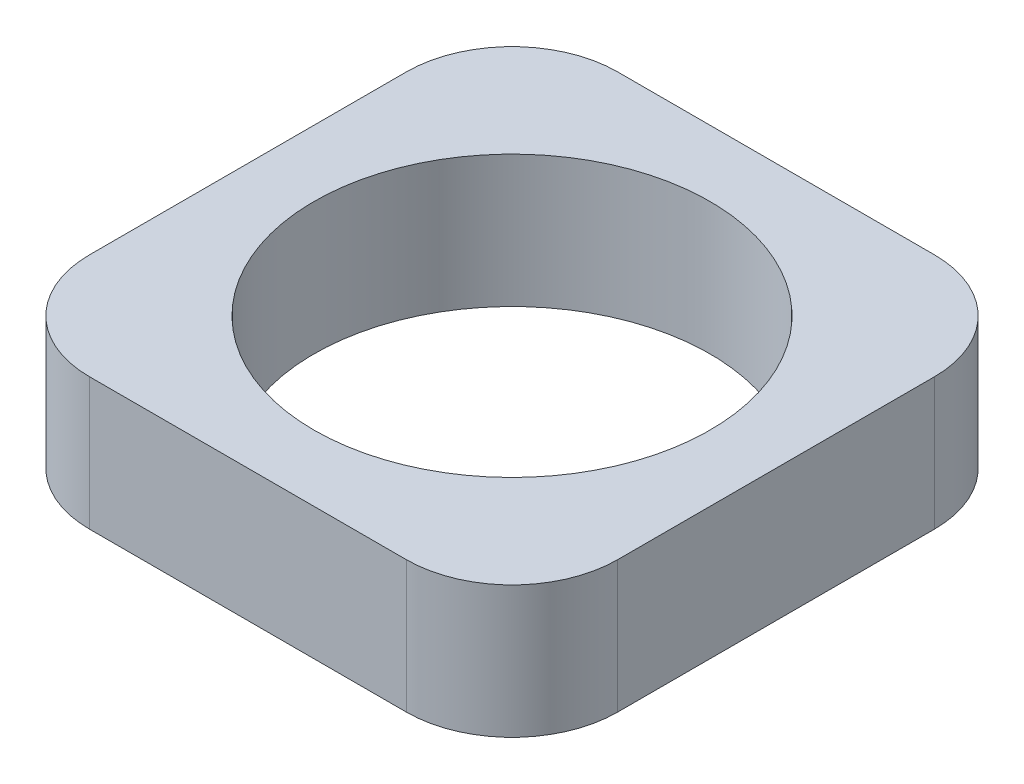
ISO-10303-21;
HEADER;
FILE_DESCRIPTION(('STEP AP214'),'2;1');
FILE_NAME('part.step','',(''),(''),'','','');
FILE_SCHEMA(('AUTOMOTIVE_DESIGN { 1 0 10303 214 1 1 1 1 }'));
ENDSEC;
DATA;
#1=APPLICATION_CONTEXT('core data for automotive mechanical design processes');
#2=APPLICATION_PROTOCOL_DEFINITION('international standard','automotive_design',2000,#1);
#3=PRODUCT_CONTEXT('',#1,'mechanical');
#4=PRODUCT('Part','Part','',(#3));
#5=PRODUCT_RELATED_PRODUCT_CATEGORY('part','',(#4));
#6=PRODUCT_DEFINITION_FORMATION('','',#4);
#7=PRODUCT_DEFINITION_CONTEXT('part definition',#1,'design');
#8=PRODUCT_DEFINITION('design','',#6,#7);
#9=PRODUCT_DEFINITION_SHAPE('','',#8);
#10=(LENGTH_UNIT() NAMED_UNIT(*) SI_UNIT(.MILLI.,.METRE.));
#11=(NAMED_UNIT(*) PLANE_ANGLE_UNIT() SI_UNIT($,.RADIAN.));
#12=(NAMED_UNIT(*) SI_UNIT($,.STERADIAN.) SOLID_ANGLE_UNIT());
#13=UNCERTAINTY_MEASURE_WITH_UNIT(LENGTH_MEASURE(1.E-05),#10,'distance_accuracy_value','');
#14=(GEOMETRIC_REPRESENTATION_CONTEXT(3) GLOBAL_UNCERTAINTY_ASSIGNED_CONTEXT((#13)) GLOBAL_UNIT_ASSIGNED_CONTEXT((#10,
#11,#12)) REPRESENTATION_CONTEXT('',''));
#15=CARTESIAN_POINT('',(0.,0.,0.));
#16=DIRECTION('',(0.,0.,1.));
#17=DIRECTION('',(1.,0.,0.));
#18=AXIS2_PLACEMENT_3D('',#15,#16,#17);
#19=CARTESIAN_POINT('',(-6.,5.,6.));
#20=DIRECTION('',(0.,-1.,0.));
#21=DIRECTION('',(0.,0.,-1.));
#22=AXIS2_PLACEMENT_3D('',#19,#20,#21);
#23=CYLINDRICAL_SURFACE('',#22,4.);
#24=CARTESIAN_POINT('',(-6.,0.,6.));
#25=DIRECTION('',(0.,1.,0.));
#26=DIRECTION('',(0.,0.,1.));
#27=AXIS2_PLACEMENT_3D('',#24,#25,#26);
#28=CIRCLE('',#27,4.);
#29=CARTESIAN_POINT('',(-10.,0.,5.99999999999997));
#30=VERTEX_POINT('',#29);
#31=CARTESIAN_POINT('',(-5.99999999999997,0.,10.));
#32=VERTEX_POINT('',#31);
#33=EDGE_CURVE('E130',#30,#32,#28,.T.);
#34=ORIENTED_EDGE('',*,*,#33,.T.);
#35=DIRECTION('',(0.,-1.,0.));
#36=VECTOR('',#35,1.);
#37=CARTESIAN_POINT('',(-5.99999999999997,5.,10.));
#38=LINE('',#37,#36);
#39=CARTESIAN_POINT('',(-5.99999999999997,5.,10.));
#40=VERTEX_POINT('',#39);
#41=EDGE_CURVE('E11',#40,#32,#38,.T.);
#42=ORIENTED_EDGE('',*,*,#41,.F.);
#43=CARTESIAN_POINT('',(-6.,5.,6.));
#44=DIRECTION('',(0.,1.,0.));
#45=DIRECTION('',(0.,0.,1.));
#46=AXIS2_PLACEMENT_3D('',#43,#44,#45);
#47=CIRCLE('',#46,4.);
#48=CARTESIAN_POINT('',(-10.,5.,5.99999999999997));
#49=VERTEX_POINT('',#48);
#50=EDGE_CURVE('E145',#49,#40,#47,.T.);
#51=ORIENTED_EDGE('',*,*,#50,.F.);
#52=DIRECTION('',(0.,-1.,0.));
#53=VECTOR('',#52,1.);
#54=CARTESIAN_POINT('',(-10.,5.,5.99999999999997));
#55=LINE('',#54,#53);
#56=EDGE_CURVE('E126',#49,#30,#55,.T.);
#57=ORIENTED_EDGE('',*,*,#56,.T.);
#58=EDGE_LOOP('',(#34,#42,#51,#57));
#59=FACE_BOUND('',#58,.T.);
#60=ADVANCED_FACE('F34',(#59),#23,.T.);
#61=CARTESIAN_POINT('',(-5.99999999999997,5.,10.));
#62=DIRECTION('',(0.,0.,-1.));
#63=DIRECTION('',(-1.,0.,0.));
#64=AXIS2_PLACEMENT_3D('',#61,#62,#63);
#65=PLANE('',#64);
#66=DIRECTION('',(1.,0.,0.));
#67=VECTOR('',#66,1.);
#68=CARTESIAN_POINT('',(-5.99999999999997,0.,10.));
#69=LINE('',#68,#67);
#70=CARTESIAN_POINT('',(5.99999999999998,0.,10.));
#71=VERTEX_POINT('',#70);
#72=EDGE_CURVE('E133',#32,#71,#69,.T.);
#73=ORIENTED_EDGE('',*,*,#72,.T.);
#74=DIRECTION('',(0.,-1.,0.));
#75=VECTOR('',#74,1.);
#76=CARTESIAN_POINT('',(5.99999999999998,5.,10.));
#77=LINE('',#76,#75);
#78=CARTESIAN_POINT('',(5.99999999999998,5.,10.));
#79=VERTEX_POINT('',#78);
#80=EDGE_CURVE('E42',#79,#71,#77,.T.);
#81=ORIENTED_EDGE('',*,*,#80,.F.);
#82=DIRECTION('',(1.,0.,0.));
#83=VECTOR('',#82,1.);
#84=CARTESIAN_POINT('',(-5.99999999999997,5.,10.));
#85=LINE('',#84,#83);
#86=EDGE_CURVE('E93',#40,#79,#85,.T.);
#87=ORIENTED_EDGE('',*,*,#86,.F.);
#88=ORIENTED_EDGE('',*,*,#41,.T.);
#89=EDGE_LOOP('',(#73,#81,#87,#88));
#90=FACE_BOUND('',#89,.T.);
#91=ADVANCED_FACE('F201',(#90),#65,.F.);
#92=CARTESIAN_POINT('',(6.,5.,6.));
#93=DIRECTION('',(0.,-1.,0.));
#94=DIRECTION('',(0.,0.,-1.));
#95=AXIS2_PLACEMENT_3D('',#92,#93,#94);
#96=CYLINDRICAL_SURFACE('',#95,4.);
#97=CARTESIAN_POINT('',(6.,0.,6.));
#98=DIRECTION('',(0.,1.,0.));
#99=DIRECTION('',(0.,0.,-1.));
#100=AXIS2_PLACEMENT_3D('',#97,#98,#99);
#101=CIRCLE('',#100,4.);
#102=CARTESIAN_POINT('',(10.,0.,5.99999999999997));
#103=VERTEX_POINT('',#102);
#104=EDGE_CURVE('E136',#71,#103,#101,.T.);
#105=ORIENTED_EDGE('',*,*,#104,.T.);
#106=DIRECTION('',(0.,-1.,0.));
#107=VECTOR('',#106,1.);
#108=CARTESIAN_POINT('',(10.,5.,5.99999999999997));
#109=LINE('',#108,#107);
#110=CARTESIAN_POINT('',(10.,5.,5.99999999999997));
#111=VERTEX_POINT('',#110);
#112=EDGE_CURVE('E152',#111,#103,#109,.T.);
#113=ORIENTED_EDGE('',*,*,#112,.F.);
#114=CARTESIAN_POINT('',(6.,5.,6.));
#115=DIRECTION('',(0.,1.,0.));
#116=DIRECTION('',(0.,0.,-1.));
#117=AXIS2_PLACEMENT_3D('',#114,#115,#116);
#118=CIRCLE('',#117,4.);
#119=EDGE_CURVE('E160',#79,#111,#118,.T.);
#120=ORIENTED_EDGE('',*,*,#119,.F.);
#121=ORIENTED_EDGE('',*,*,#80,.T.);
#122=EDGE_LOOP('',(#105,#113,#120,#121));
#123=FACE_BOUND('',#122,.T.);
#124=ADVANCED_FACE('F158',(#123),#96,.T.);
#125=CARTESIAN_POINT('',(10.,5.,5.99999999999997));
#126=DIRECTION('',(-1.,0.,0.));
#127=DIRECTION('',(0.,0.,1.));
#128=AXIS2_PLACEMENT_3D('',#125,#126,#127);
#129=PLANE('',#128);
#130=DIRECTION('',(0.,0.,-1.));
#131=VECTOR('',#130,1.);
#132=CARTESIAN_POINT('',(10.,0.,5.99999999999997));
#133=LINE('',#132,#131);
#134=CARTESIAN_POINT('',(10.,0.,-5.99999999999997));
#135=VERTEX_POINT('',#134);
#136=EDGE_CURVE('E138',#103,#135,#133,.T.);
#137=ORIENTED_EDGE('',*,*,#136,.T.);
#138=DIRECTION('',(0.,-1.,0.));
#139=VECTOR('',#138,1.);
#140=CARTESIAN_POINT('',(10.,5.,-5.99999999999997));
#141=LINE('',#140,#139);
#142=CARTESIAN_POINT('',(10.,5.,-5.99999999999997));
#143=VERTEX_POINT('',#142);
#144=EDGE_CURVE('E149',#143,#135,#141,.T.);
#145=ORIENTED_EDGE('',*,*,#144,.F.);
#146=DIRECTION('',(0.,0.,-1.));
#147=VECTOR('',#146,1.);
#148=CARTESIAN_POINT('',(10.,5.,5.99999999999997));
#149=LINE('',#148,#147);
#150=EDGE_CURVE('E172',#111,#143,#149,.T.);
#151=ORIENTED_EDGE('',*,*,#150,.F.);
#152=ORIENTED_EDGE('',*,*,#112,.T.);
#153=EDGE_LOOP('',(#137,#145,#151,#152));
#154=FACE_BOUND('',#153,.T.);
#155=ADVANCED_FACE('F168',(#154),#129,.F.);
#156=CARTESIAN_POINT('',(6.,5.,-6.));
#157=DIRECTION('',(0.,-1.,0.));
#158=DIRECTION('',(0.,0.,-1.));
#159=AXIS2_PLACEMENT_3D('',#156,#157,#158);
#160=CYLINDRICAL_SURFACE('',#159,4.);
#161=CARTESIAN_POINT('',(6.,0.,-6.));
#162=DIRECTION('',(0.,1.,0.));
#163=DIRECTION('',(0.,0.,1.));
#164=AXIS2_PLACEMENT_3D('',#161,#162,#163);
#165=CIRCLE('',#164,4.);
#166=CARTESIAN_POINT('',(5.99999999999998,0.,-10.));
#167=VERTEX_POINT('',#166);
#168=EDGE_CURVE('E140',#135,#167,#165,.T.);
#169=ORIENTED_EDGE('',*,*,#168,.T.);
#170=DIRECTION('',(0.,-1.,0.));
#171=VECTOR('',#170,1.);
#172=CARTESIAN_POINT('',(5.99999999999998,5.,-10.));
#173=LINE('',#172,#171);
#174=CARTESIAN_POINT('',(5.99999999999998,5.,-10.));
#175=VERTEX_POINT('',#174);
#176=EDGE_CURVE('E121',#175,#167,#173,.T.);
#177=ORIENTED_EDGE('',*,*,#176,.F.);
#178=CARTESIAN_POINT('',(6.,5.,-6.));
#179=DIRECTION('',(0.,1.,0.));
#180=DIRECTION('',(0.,0.,1.));
#181=AXIS2_PLACEMENT_3D('',#178,#179,#180);
#182=CIRCLE('',#181,4.);
#183=EDGE_CURVE('E112',#143,#175,#182,.T.);
#184=ORIENTED_EDGE('',*,*,#183,.F.);
#185=ORIENTED_EDGE('',*,*,#144,.T.);
#186=EDGE_LOOP('',(#169,#177,#184,#185));
#187=FACE_BOUND('',#186,.T.);
#188=ADVANCED_FACE('F171',(#187),#160,.T.);
#189=CARTESIAN_POINT('',(-5.99999999999997,5.,-10.));
#190=DIRECTION('',(0.,0.,1.));
#191=DIRECTION('',(1.,0.,0.));
#192=AXIS2_PLACEMENT_3D('',#189,#190,#191);
#193=PLANE('',#192);
#194=DIRECTION('',(-1.,0.,0.));
#195=VECTOR('',#194,1.);
#196=CARTESIAN_POINT('',(-5.99999999999997,0.,-10.));
#197=LINE('',#196,#195);
#198=CARTESIAN_POINT('',(-6.,0.,-10.));
#199=VERTEX_POINT('',#198);
#200=EDGE_CURVE('E120',#167,#199,#197,.T.);
#201=ORIENTED_EDGE('',*,*,#200,.T.);
#202=DIRECTION('',(0.,-1.,0.));
#203=VECTOR('',#202,1.);
#204=CARTESIAN_POINT('',(-6.,5.,-10.));
#205=LINE('',#204,#203);
#206=CARTESIAN_POINT('',(-6.,5.,-10.));
#207=VERTEX_POINT('',#206);
#208=EDGE_CURVE('E117',#207,#199,#205,.T.);
#209=ORIENTED_EDGE('',*,*,#208,.F.);
#210=DIRECTION('',(-1.,0.,0.));
#211=VECTOR('',#210,1.);
#212=CARTESIAN_POINT('',(-5.99999999999997,5.,-10.));
#213=LINE('',#212,#211);
#214=EDGE_CURVE('E106',#175,#207,#213,.T.);
#215=ORIENTED_EDGE('',*,*,#214,.F.);
#216=ORIENTED_EDGE('',*,*,#176,.T.);
#217=EDGE_LOOP('',(#201,#209,#215,#216));
#218=FACE_BOUND('',#217,.T.);
#219=ADVANCED_FACE('F118',(#218),#193,.F.);
#220=CARTESIAN_POINT('',(-6.,5.,-6.));
#221=DIRECTION('',(0.,-1.,0.));
#222=DIRECTION('',(0.,0.,-1.));
#223=AXIS2_PLACEMENT_3D('',#220,#221,#222);
#224=CYLINDRICAL_SURFACE('',#223,4.);
#225=CARTESIAN_POINT('',(-6.,0.,-6.));
#226=DIRECTION('',(0.,1.,0.));
#227=DIRECTION('',(0.,0.,-1.));
#228=AXIS2_PLACEMENT_3D('',#225,#226,#227);
#229=CIRCLE('',#228,4.);
#230=CARTESIAN_POINT('',(-10.,0.,-5.99999999999997));
#231=VERTEX_POINT('',#230);
#232=EDGE_CURVE('E79',#199,#231,#229,.T.);
#233=ORIENTED_EDGE('',*,*,#232,.T.);
#234=DIRECTION('',(0.,-1.,0.));
#235=VECTOR('',#234,1.);
#236=CARTESIAN_POINT('',(-10.,5.,-5.99999999999997));
#237=LINE('',#236,#235);
#238=CARTESIAN_POINT('',(-10.,5.,-5.99999999999997));
#239=VERTEX_POINT('',#238);
#240=EDGE_CURVE('E122',#239,#231,#237,.T.);
#241=ORIENTED_EDGE('',*,*,#240,.F.);
#242=CARTESIAN_POINT('',(-6.,5.,-6.));
#243=DIRECTION('',(0.,1.,0.));
#244=DIRECTION('',(0.,0.,-1.));
#245=AXIS2_PLACEMENT_3D('',#242,#243,#244);
#246=CIRCLE('',#245,4.);
#247=EDGE_CURVE('E110',#207,#239,#246,.T.);
#248=ORIENTED_EDGE('',*,*,#247,.F.);
#249=ORIENTED_EDGE('',*,*,#208,.T.);
#250=EDGE_LOOP('',(#233,#241,#248,#249));
#251=FACE_BOUND('',#250,.T.);
#252=ADVANCED_FACE('F124',(#251),#224,.T.);
#253=CARTESIAN_POINT('',(-10.,5.,5.99999999999997));
#254=DIRECTION('',(1.,0.,0.));
#255=DIRECTION('',(0.,0.,-1.));
#256=AXIS2_PLACEMENT_3D('',#253,#254,#255);
#257=PLANE('',#256);
#258=DIRECTION('',(0.,0.,1.));
#259=VECTOR('',#258,1.);
#260=CARTESIAN_POINT('',(-10.,0.,5.99999999999997));
#261=LINE('',#260,#259);
#262=EDGE_CURVE('E85',#231,#30,#261,.T.);
#263=ORIENTED_EDGE('',*,*,#262,.T.);
#264=ORIENTED_EDGE('',*,*,#56,.F.);
#265=DIRECTION('',(0.,0.,1.));
#266=VECTOR('',#265,1.);
#267=CARTESIAN_POINT('',(-10.,5.,5.99999999999997));
#268=LINE('',#267,#266);
#269=EDGE_CURVE('E50',#239,#49,#268,.T.);
#270=ORIENTED_EDGE('',*,*,#269,.F.);
#271=ORIENTED_EDGE('',*,*,#240,.T.);
#272=EDGE_LOOP('',(#263,#264,#270,#271));
#273=FACE_BOUND('',#272,.T.);
#274=ADVANCED_FACE('F192',(#273),#257,.F.);
#275=CARTESIAN_POINT('',(-6.,5.,6.));
#276=DIRECTION('',(0.,1.,0.));
#277=DIRECTION('',(0.,0.,1.));
#278=AXIS2_PLACEMENT_3D('',#275,#276,#277);
#279=PLANE('',#278);
#280=CARTESIAN_POINT('',(0.,5.,0.));
#281=DIRECTION('',(0.,1.,0.));
#282=DIRECTION('',(0.,0.,1.));
#283=AXIS2_PLACEMENT_3D('',#280,#281,#282);
#284=CIRCLE('',#283,7.5);
#285=CARTESIAN_POINT('',(0.,5.,7.5));
#286=VERTEX_POINT('',#285);
#287=EDGE_CURVE('E178',#286,#286,#284,.T.);
#288=ORIENTED_EDGE('',*,*,#287,.F.);
#289=EDGE_LOOP('',(#288));
#290=FACE_BOUND('',#289,.T.);
#291=ORIENTED_EDGE('',*,*,#50,.T.);
#292=ORIENTED_EDGE('',*,*,#86,.T.);
#293=ORIENTED_EDGE('',*,*,#119,.T.);
#294=ORIENTED_EDGE('',*,*,#150,.T.);
#295=ORIENTED_EDGE('',*,*,#183,.T.);
#296=ORIENTED_EDGE('',*,*,#214,.T.);
#297=ORIENTED_EDGE('',*,*,#247,.T.);
#298=ORIENTED_EDGE('',*,*,#269,.T.);
#299=EDGE_LOOP('',(#291,#292,#293,#294,#295,#296,#297,#298));
#300=FACE_BOUND('',#299,.T.);
#301=ADVANCED_FACE('F108',(#290,#300),#279,.T.);
#302=CARTESIAN_POINT('',(-6.,0.,6.));
#303=DIRECTION('',(0.,1.,0.));
#304=DIRECTION('',(0.,0.,1.));
#305=AXIS2_PLACEMENT_3D('',#302,#303,#304);
#306=PLANE('',#305);
#307=CARTESIAN_POINT('',(0.,0.,0.));
#308=DIRECTION('',(0.,1.,0.));
#309=DIRECTION('',(0.,0.,1.));
#310=AXIS2_PLACEMENT_3D('',#307,#308,#309);
#311=CIRCLE('',#310,7.5);
#312=CARTESIAN_POINT('',(0.,0.,7.5));
#313=VERTEX_POINT('',#312);
#314=EDGE_CURVE('E134',#313,#313,#311,.T.);
#315=ORIENTED_EDGE('',*,*,#314,.T.);
#316=EDGE_LOOP('',(#315));
#317=FACE_BOUND('',#316,.T.);
#318=ORIENTED_EDGE('',*,*,#33,.F.);
#319=ORIENTED_EDGE('',*,*,#262,.F.);
#320=ORIENTED_EDGE('',*,*,#232,.F.);
#321=ORIENTED_EDGE('',*,*,#200,.F.);
#322=ORIENTED_EDGE('',*,*,#168,.F.);
#323=ORIENTED_EDGE('',*,*,#136,.F.);
#324=ORIENTED_EDGE('',*,*,#104,.F.);
#325=ORIENTED_EDGE('',*,*,#72,.F.);
#326=EDGE_LOOP('',(#318,#319,#320,#321,#322,#323,#324,#325));
#327=FACE_BOUND('',#326,.T.);
#328=ADVANCED_FACE('F164',(#317,#327),#306,.F.);
#329=CARTESIAN_POINT('',(0.,0.,0.));
#330=DIRECTION('',(0.,1.,0.));
#331=DIRECTION('',(0.,0.,1.));
#332=AXIS2_PLACEMENT_3D('',#329,#330,#331);
#333=CYLINDRICAL_SURFACE('',#332,7.5);
#334=ORIENTED_EDGE('',*,*,#314,.F.);
#335=EDGE_LOOP('',(#334));
#336=FACE_BOUND('',#335,.T.);
#337=ORIENTED_EDGE('',*,*,#287,.T.);
#338=EDGE_LOOP('',(#337));
#339=FACE_BOUND('',#338,.T.);
#340=ADVANCED_FACE('F185',(#336,#339),#333,.F.);
#341=CLOSED_SHELL('',(#60,#91,#124,#155,#188,#219,#252,#274,#301,#328,#340));
#342=MANIFOLD_SOLID_BREP('B2',#341);
#343=ADVANCED_BREP_SHAPE_REPRESENTATION('',(#18,#342),#14);
#344=SHAPE_DEFINITION_REPRESENTATION(#9,#343);
ENDSEC;
END-ISO-10303-21;
